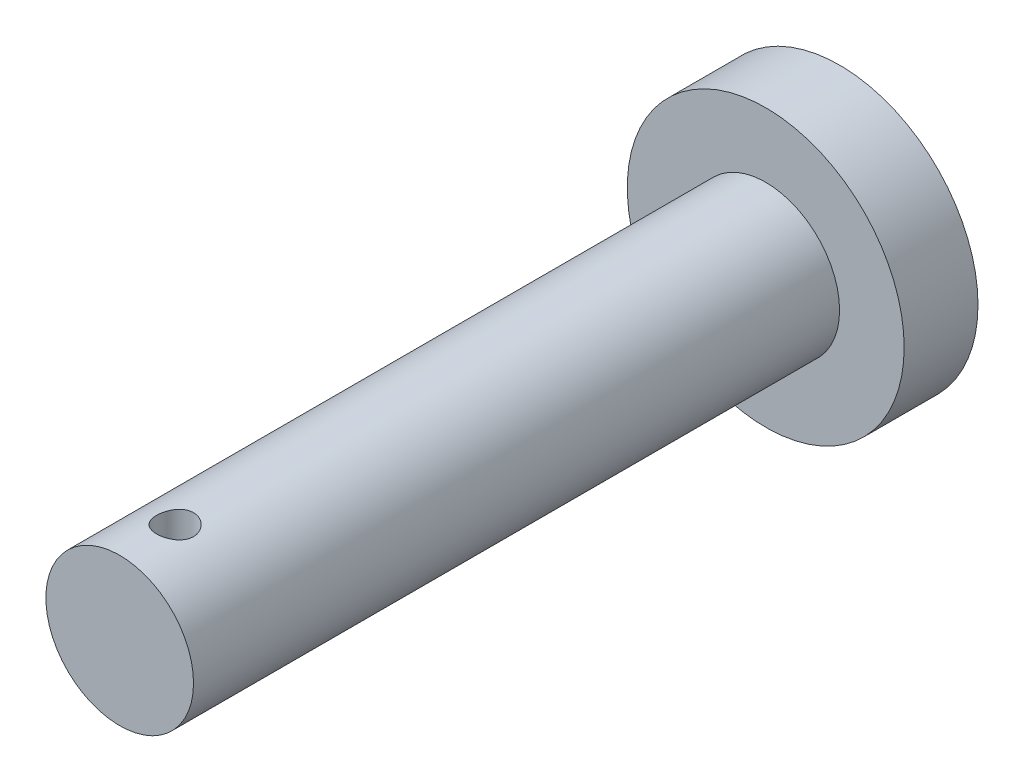
ISO-10303-21;
HEADER;
FILE_DESCRIPTION(('STEP AP214'),'2;1');
FILE_NAME('part.step','',(''),(''),'','','');
FILE_SCHEMA(('AUTOMOTIVE_DESIGN { 1 0 10303 214 1 1 1 1 }'));
ENDSEC;
DATA;
#1=APPLICATION_CONTEXT('core data for automotive mechanical design processes');
#2=APPLICATION_PROTOCOL_DEFINITION('international standard','automotive_design',2000,#1);
#3=PRODUCT_CONTEXT('',#1,'mechanical');
#4=PRODUCT('Part','Part','',(#3));
#5=PRODUCT_RELATED_PRODUCT_CATEGORY('part','',(#4));
#6=PRODUCT_DEFINITION_FORMATION('','',#4);
#7=PRODUCT_DEFINITION_CONTEXT('part definition',#1,'design');
#8=PRODUCT_DEFINITION('design','',#6,#7);
#9=PRODUCT_DEFINITION_SHAPE('','',#8);
#10=(LENGTH_UNIT() NAMED_UNIT(*) SI_UNIT(.MILLI.,.METRE.));
#11=(NAMED_UNIT(*) PLANE_ANGLE_UNIT() SI_UNIT($,.RADIAN.));
#12=(NAMED_UNIT(*) SI_UNIT($,.STERADIAN.) SOLID_ANGLE_UNIT());
#13=UNCERTAINTY_MEASURE_WITH_UNIT(LENGTH_MEASURE(1.E-05),#10,'distance_accuracy_value','');
#14=(GEOMETRIC_REPRESENTATION_CONTEXT(3) GLOBAL_UNCERTAINTY_ASSIGNED_CONTEXT((#13)) GLOBAL_UNIT_ASSIGNED_CONTEXT((#10,
#11,#12)) REPRESENTATION_CONTEXT('',''));
#15=CARTESIAN_POINT('',(0.,0.,0.));
#16=DIRECTION('',(0.,0.,1.));
#17=DIRECTION('',(1.,0.,0.));
#18=AXIS2_PLACEMENT_3D('',#15,#16,#17);
#19=CARTESIAN_POINT('',(0.,0.,8.75));
#20=DIRECTION('',(0.,0.,-1.));
#21=DIRECTION('',(1.,0.,0.));
#22=AXIS2_PLACEMENT_3D('',#19,#20,#21);
#23=CYLINDRICAL_SURFACE('',#22,2.);
#24=CARTESIAN_POINT('',(-0.402083580843982,-1.95916533095591,7.60170386885956));
#25=CARTESIAN_POINT('',(-0.382401175035829,-1.96320453400655,7.62431189247968));
#26=CARTESIAN_POINT('',(-0.360815571009597,-1.96732486967158,7.64525975378583));
#27=CARTESIAN_POINT('',(-0.314396918326236,-1.97527428498154,7.68326948825497));
#28=CARTESIAN_POINT('',(-0.289562381598017,-1.97910322988524,7.70032957086576));
#29=CARTESIAN_POINT('',(-0.237271935828046,-1.98605068903638,7.73007891141228));
#30=CARTESIAN_POINT('',(-0.209813569143578,-1.98916852777608,7.74276401919614));
#31=CARTESIAN_POINT('',(-0.153061270678351,-1.9943376980813,7.76332808373494));
#32=CARTESIAN_POINT('',(-0.123767884887116,-1.99638934520723,7.77120846266375));
#33=CARTESIAN_POINT('',(-0.0648800240902694,-1.99915973139406,7.78176902698042));
#34=CARTESIAN_POINT('',(-0.0353072409939558,-1.99990748930074,7.78456248921268));
#35=CARTESIAN_POINT('',(0.0238936744461542,-2.00007622698689,7.78519660071162));
#36=CARTESIAN_POINT('',(0.0535218008166035,-1.9994973425232,7.78303775675343));
#37=CARTESIAN_POINT('',(0.111331465837118,-1.99710418290124,7.77394485929492));
#38=CARTESIAN_POINT('',(0.139530373697293,-1.99531647652923,7.76711346757842));
#39=CARTESIAN_POINT('',(0.1943740712685,-1.99072263791091,7.74900752131947));
#40=CARTESIAN_POINT('',(0.221018727307608,-1.9879164182178,7.73773258525919));
#41=CARTESIAN_POINT('',(0.272493898277129,-1.98152252101768,7.71085574014534));
#42=CARTESIAN_POINT('',(0.297287002434992,-1.97792265637125,7.69518517789974));
#43=CARTESIAN_POINT('',(0.34394591219118,-1.97034536260905,7.66003671689537));
#44=CARTESIAN_POINT('',(0.365811119590012,-1.96636785662009,7.64055804209364));
#45=CARTESIAN_POINT('',(0.406709383766492,-1.95832481038612,7.59762721054773));
#46=CARTESIAN_POINT('',(0.425632191296246,-1.95426041836359,7.57406964775141));
#47=CARTESIAN_POINT('',(0.459279386022715,-1.94662813434441,7.52405100075266));
#48=CARTESIAN_POINT('',(0.474003707806079,-1.9430602500839,7.4975898713209));
#49=CARTESIAN_POINT('',(0.498833097654135,-1.93683518055102,7.44243594697692));
#50=CARTESIAN_POINT('',(0.508932196848207,-1.93417917315964,7.4137403239719));
#51=CARTESIAN_POINT('',(0.524143555506589,-1.93011306386062,7.3549735294201));
#52=CARTESIAN_POINT('',(0.529257039322722,-1.92870265607053,7.32490269749281));
#53=CARTESIAN_POINT('',(0.534238993776694,-1.92732848979126,7.26521858503779));
#54=CARTESIAN_POINT('',(0.534261929587191,-1.92732212764184,7.23561911374268));
#55=CARTESIAN_POINT('',(0.529449044191111,-1.92864973017506,7.17685047794165));
#56=CARTESIAN_POINT('',(0.524613488673774,-1.92998362156521,7.14768128999395));
#57=CARTESIAN_POINT('',(0.51033810064097,-1.93380664655718,7.09095829090651));
#58=CARTESIAN_POINT('',(0.50095529736206,-1.93628145312418,7.06338908745715));
#59=CARTESIAN_POINT('',(0.477899533396954,-1.94210006766961,7.01020622089649));
#60=CARTESIAN_POINT('',(0.464225917448787,-1.94544400836252,6.98459285721023));
#61=CARTESIAN_POINT('',(0.432561139580522,-1.95273160373383,6.93533026464054));
#62=CARTESIAN_POINT('',(0.414467700500976,-1.95668850353783,6.91174874714225));
#63=CARTESIAN_POINT('',(0.37463859004048,-1.96470299210552,6.86790918346495));
#64=CARTESIAN_POINT('',(0.352902334366307,-1.9687605969328,6.84765167147639));
#65=CARTESIAN_POINT('',(0.305806084041395,-1.97662955590711,6.81057614514322));
#66=CARTESIAN_POINT('',(0.280375248121333,-1.9804332647147,6.79384628732205));
#67=CARTESIAN_POINT('',(0.226957723627396,-1.98726295050511,6.7649191541237));
#68=CARTESIAN_POINT('',(0.198971345554694,-1.99028902180179,6.75272132901003));
#69=CARTESIAN_POINT('',(0.141711815283119,-1.99517647558453,6.73342075982819));
#70=CARTESIAN_POINT('',(0.112467490496456,-1.99705624019162,6.72623731800307));
#71=CARTESIAN_POINT('',(0.0531353405688532,-1.99951425246894,6.71689797425931));
#72=CARTESIAN_POINT('',(0.0230476995457652,-2.00009278202587,6.71474098345633));
#73=CARTESIAN_POINT('',(-0.0361223368669313,-1.99988595249718,6.7155186309777));
#74=CARTESIAN_POINT('',(-0.065207055479595,-1.99914220210434,6.71829793431269));
#75=CARTESIAN_POINT('',(-0.122477108921468,-1.99645220354969,6.7285517866559));
#76=CARTESIAN_POINT('',(-0.15066244351078,-1.99450595506714,6.73602633691649));
#77=CARTESIAN_POINT('',(-0.205357247671967,-1.98961878937712,6.7554239408597));
#78=CARTESIAN_POINT('',(-0.231866944263665,-1.98667800725598,6.76734639041207));
#79=CARTESIAN_POINT('',(-0.282540037837243,-1.98010727269151,6.79528458288575));
#80=CARTESIAN_POINT('',(-0.306703019910216,-1.97647719871257,6.81130104783455));
#81=CARTESIAN_POINT('',(-0.352789635866894,-1.96878197784867,6.84754374843005));
#82=CARTESIAN_POINT('',(-0.374622185099011,-1.96470692049263,6.86788374971425));
#83=CARTESIAN_POINT('',(-0.414616844985319,-1.95665786154173,6.91192031050817));
#84=CARTESIAN_POINT('',(-0.43277842113705,-1.95268387473652,6.93561735795871));
#85=CARTESIAN_POINT('',(-0.465242092248771,-1.94520777129324,6.98622650854431));
#86=CARTESIAN_POINT('',(-0.479466866493781,-1.94171570399899,7.01318982728125));
#87=CARTESIAN_POINT('',(-0.503166821482325,-1.93571012206215,7.06923005548123));
#88=CARTESIAN_POINT('',(-0.512642908818691,-1.93319642065587,7.09830656029191));
#89=CARTESIAN_POINT('',(-0.526379909890084,-1.92950102843636,7.15710150912883));
#90=CARTESIAN_POINT('',(-0.530746430903256,-1.92829240581666,7.18679354609653));
#91=CARTESIAN_POINT('',(-0.534466824981242,-1.92726471650606,7.24651406491472));
#92=CARTESIAN_POINT('',(-0.533821175775814,-1.92744551738369,7.27654251442796));
#93=CARTESIAN_POINT('',(-0.527625576438523,-1.92915023983919,7.33524851481118));
#94=CARTESIAN_POINT('',(-0.522204404438363,-1.93063889075532,7.36394085357697));
#95=CARTESIAN_POINT('',(-0.506814027497609,-1.93473574447013,7.41998527688823));
#96=CARTESIAN_POINT('',(-0.496846170277648,-1.93734361549798,7.44733775593389));
#97=CARTESIAN_POINT('',(-0.474100057999968,-1.94302567989786,7.49687703522856));
#98=CARTESIAN_POINT('',(-0.461792463231296,-1.94600848475939,7.51929246943399));
#99=CARTESIAN_POINT('',(-0.434142225349449,-1.95236310269926,7.56210584075319));
#100=CARTESIAN_POINT('',(-0.418799252614142,-1.95573495800935,7.58250355839501));
#101=CARTESIAN_POINT('',(-0.402083580843982,-1.95916533095591,7.60170386885956));
#102=B_SPLINE_CURVE_WITH_KNOTS('',3,(#24,#25,#26,#27,#28,#29,#30,#31,#32,#33,#34,#35,#36,#37,
#38,#39,#40,#41,#42,#43,#44,#45,#46,#47,#48,#49,#50,#51,#52,#53,#54,#55,#56,#57,#58,#59,#60,#61,
#62,#63,#64,#65,#66,#67,#68,#69,#70,#71,#72,#73,#74,#75,#76,#77,#78,#79,#80,#81,#82,#83,#84,#85,
#86,#87,#88,#89,#90,#91,#92,#93,#94,#95,#96,#97,#98,#99,#100,#101),.UNSPECIFIED.,.T.,.F.,(4,2,2,
2,2,2,2,2,2,2,2,2,2,2,2,2,2,2,2,2,2,2,2,2,2,2,2,2,2,2,2,2,2,2,2,2,2,2,4),(0.,0.0906485431880672,
0.18133875139868,0.272114754284168,0.362863874901053,0.451566234355926,0.540259517202652,
0.627064172981433,0.713876283336905,0.802127989254279,0.890397698483535,0.981434068915705,
1.0724718576375,1.1636268022619,1.25475935569766,1.34312623618703,1.43148828454849,
1.51876974624767,1.60606454343425,1.69561121236824,1.78517225800044,1.87675896967833,
1.96833456823951,2.05840014949195,2.14844621794647,2.23570871575389,2.32297123683707,
2.4102219099119,2.49748798129301,2.58742287685325,2.67737085773161,2.76897700941261,
2.86056566548866,2.95022587161817,3.0398775319839,3.12718318284317,3.21446297151177,
3.29143967295109,3.36842473814811),.UNSPECIFIED.);
#103=CARTESIAN_POINT('',(-0.402083580843982,-1.95916533095591,7.60170386885956));
#104=VERTEX_POINT('',#103);
#105=EDGE_CURVE('E36',#104,#104,#102,.T.);
#106=ORIENTED_EDGE('',*,*,#105,.T.);
#107=EDGE_LOOP('',(#106));
#108=FACE_BOUND('',#107,.T.);
#109=CARTESIAN_POINT('',(0.,0.,-8.75));
#110=DIRECTION('',(0.,0.,1.));
#111=DIRECTION('',(1.,0.,0.));
#112=AXIS2_PLACEMENT_3D('',#109,#110,#111);
#113=CIRCLE('',#112,2.);
#114=CARTESIAN_POINT('',(2.,0.,-8.75));
#115=VERTEX_POINT('',#114);
#116=EDGE_CURVE('E43',#115,#115,#113,.T.);
#117=ORIENTED_EDGE('',*,*,#116,.T.);
#118=EDGE_LOOP('',(#117));
#119=FACE_BOUND('',#118,.T.);
#120=CARTESIAN_POINT('',(0.,0.,8.75));
#121=DIRECTION('',(0.,0.,1.));
#122=DIRECTION('',(1.,0.,0.));
#123=AXIS2_PLACEMENT_3D('',#120,#121,#122);
#124=CIRCLE('',#123,2.);
#125=CARTESIAN_POINT('',(2.,0.,8.75));
#126=VERTEX_POINT('',#125);
#127=EDGE_CURVE('E10',#126,#126,#124,.T.);
#128=ORIENTED_EDGE('',*,*,#127,.F.);
#129=EDGE_LOOP('',(#128));
#130=FACE_BOUND('',#129,.T.);
#131=CARTESIAN_POINT('',(0.,2.,7.75));
#132=CARTESIAN_POINT('',(0.0276253628899104,1.99999953289338,7.74999922475395));
#133=CARTESIAN_POINT('',(0.0552593859435877,1.99942192710609,7.74770281640874));
#134=CARTESIAN_POINT('',(0.109735441256844,1.99717371276631,7.738591616231));
#135=CARTESIAN_POINT('',(0.13657701562358,1.99550248473323,7.73177426348739));
#136=CARTESIAN_POINT('',(0.188673624060859,1.99125208777347,7.71385358217931));
#137=CARTESIAN_POINT('',(0.213930521143335,1.98867400947362,7.70275540042824));
#138=CARTESIAN_POINT('',(0.262224043968142,1.98288447935864,7.67660620331839));
#139=CARTESIAN_POINT('',(0.28526059478292,1.97967300618017,7.66155505462702));
#140=CARTESIAN_POINT('',(0.328933975766973,1.97289137863934,7.62759973678193));
#141=CARTESIAN_POINT('',(0.349518563353691,1.96931569049511,7.60862947501361));
#142=CARTESIAN_POINT('',(0.387249642401102,1.96224540039176,7.56751593169703));
#143=CARTESIAN_POINT('',(0.404395745649712,1.95875080762783,7.54537229235117));
#144=CARTESIAN_POINT('',(0.435008847599677,1.9521825856657,7.49813492442086));
#145=CARTESIAN_POINT('',(0.448417405308452,1.94911598156868,7.47300225639653));
#146=CARTESIAN_POINT('',(0.470798969516843,1.94383164937408,7.42075052944721));
#147=CARTESIAN_POINT('',(0.479772685146444,1.94161378557596,7.39363178889141));
#148=CARTESIAN_POINT('',(0.492851612268097,1.93833492239184,7.33875216726584));
#149=CARTESIAN_POINT('',(0.497050756111113,1.93725163691809,7.31101503465007));
#150=CARTESIAN_POINT('',(0.500753925022618,1.9362978751258,7.25521047699534));
#151=CARTESIAN_POINT('',(0.500258713939326,1.93642720149548,7.2271431064338));
#152=CARTESIAN_POINT('',(0.49466217487976,1.93786401832206,7.17219473075184));
#153=CARTESIAN_POINT('',(0.489672780063507,1.93914287667293,7.14530145951163));
#154=CARTESIAN_POINT('',(0.475408062301036,1.94268903225495,7.0927463163629));
#155=CARTESIAN_POINT('',(0.466132434023141,1.94495639990232,7.06708453232367));
#156=CARTESIAN_POINT('',(0.443463159312385,1.95025037968062,7.01742066124931));
#157=CARTESIAN_POINT('',(0.430028889077637,1.95328442489807,6.99343794273682));
#158=CARTESIAN_POINT('',(0.399452092004984,1.95976570282129,6.94802709674772));
#159=CARTESIAN_POINT('',(0.382308916269613,1.96321300778245,6.92659941731092));
#160=CARTESIAN_POINT('',(0.344221141560406,1.9702529351326,6.8862654614352));
#161=CARTESIAN_POINT('',(0.323182086055287,1.9738468982599,6.86744850331288));
#162=CARTESIAN_POINT('',(0.278203972501233,1.98068655192929,6.8335929191787));
#163=CARTESIAN_POINT('',(0.254264825902648,1.98393223183138,6.81855440857881));
#164=CARTESIAN_POINT('',(0.204038629560463,1.98972577364727,6.79264980459187));
#165=CARTESIAN_POINT('',(0.177743797736207,1.99227120042575,6.78179821991519));
#166=CARTESIAN_POINT('',(0.123625336047627,1.99635972330473,6.76469423143014));
#167=CARTESIAN_POINT('',(0.0958019997168275,1.99790301113094,6.75844094786062));
#168=CARTESIAN_POINT('',(0.0401799901300081,1.99978499757125,6.75084747814705));
#169=CARTESIAN_POINT('',(0.0123989066627358,2.00015351169426,6.7493856579749));
#170=CARTESIAN_POINT('',(-0.0430109582671701,1.9997293493815,6.75108300068516));
#171=CARTESIAN_POINT('',(-0.0706397532148657,1.99893677747282,6.75424174759971));
#172=CARTESIAN_POINT('',(-0.124538089592164,1.99629860375786,6.76499030279713));
#173=CARTESIAN_POINT('',(-0.150821706322919,1.99446878061937,6.77251375449233));
#174=CARTESIAN_POINT('',(-0.201752430817504,1.98996235544711,6.79170236134282));
#175=CARTESIAN_POINT('',(-0.226399373010879,1.98728566789964,6.80336793477106));
#176=CARTESIAN_POINT('',(-0.27384104480995,1.98131102642103,6.83074537629158));
#177=CARTESIAN_POINT('',(-0.296595147278611,1.97800289122311,6.84652537079892));
#178=CARTESIAN_POINT('',(-0.339175537881083,1.97114836395806,6.88159663626566));
#179=CARTESIAN_POINT('',(-0.35900131965767,1.96760193083902,6.90088851320564));
#180=CARTESIAN_POINT('',(-0.395663522690911,1.96056318986924,6.94300065361482));
#181=CARTESIAN_POINT('',(-0.412414622540678,1.95707434729094,6.96589590100081));
#182=CARTESIAN_POINT('',(-0.441836919670899,1.95064292792413,7.01424421148857));
#183=CARTESIAN_POINT('',(-0.454508298052646,1.94770032689009,7.03969716098659));
#184=CARTESIAN_POINT('',(-0.475317140203098,1.94272698244888,7.09230190747103));
#185=CARTESIAN_POINT('',(-0.483481465551355,1.94069085097302,7.11944254278134));
#186=CARTESIAN_POINT('',(-0.495115219984593,1.93775581363394,7.17476987929637));
#187=CARTESIAN_POINT('',(-0.498585675826219,1.93685665906645,7.20295635034416));
#188=CARTESIAN_POINT('',(-0.500679530111332,1.93631633734652,7.25870700795174));
#189=CARTESIAN_POINT('',(-0.499439299260039,1.93663977576088,7.28626581170825));
#190=CARTESIAN_POINT('',(-0.492459092770956,1.93842636335948,7.34076796288933));
#191=CARTESIAN_POINT('',(-0.486719207562256,1.93988948963952,7.36771132267122));
#192=CARTESIAN_POINT('',(-0.470977106480931,1.94377086894241,7.42006948635514));
#193=CARTESIAN_POINT('',(-0.461000468226792,1.94618338412103,7.44549243508007));
#194=CARTESIAN_POINT('',(-0.437088304535023,1.95169251908276,7.4943217942379));
#195=CARTESIAN_POINT('',(-0.423152230011396,1.95478923373591,7.51772792439564));
#196=CARTESIAN_POINT('',(-0.391289249545712,1.96141878087837,7.56251820966734));
#197=CARTESIAN_POINT('',(-0.373267720970751,1.96496088277252,7.58383369114132));
#198=CARTESIAN_POINT('',(-0.333929790396578,1.97202675748762,7.62318234826514));
#199=CARTESIAN_POINT('',(-0.312612607087048,1.97555052575687,7.64121474337099));
#200=CARTESIAN_POINT('',(-0.266822528900863,1.98225885215888,7.67380376952154));
#201=CARTESIAN_POINT('',(-0.242299474105462,1.98543611121956,7.68829153789053));
#202=CARTESIAN_POINT('',(-0.191088686503491,1.99101641658373,7.71291582098018));
#203=CARTESIAN_POINT('',(-0.164402521145579,1.9934200173326,7.72305545354951));
#204=CARTESIAN_POINT('',(-0.114803417747823,1.99682686521847,7.73719061010989));
#205=CARTESIAN_POINT('',(-0.0921267236360225,1.9980086168423,7.74198374768448));
#206=CARTESIAN_POINT('',(-0.0463020238454277,1.99959535077316,7.74838864787398));
#207=CARTESIAN_POINT('',(-0.0231540537475387,2.00000039150298,7.75000064976844));
#208=CARTESIAN_POINT('',(0.,2.,7.75));
#209=B_SPLINE_CURVE_WITH_KNOTS('',3,(#131,#132,#133,#134,#135,#136,#137,#138,#139,#140,#141,
#142,#143,#144,#145,#146,#147,#148,#149,#150,#151,#152,#153,#154,#155,#156,#157,#158,#159,#160,
#161,#162,#163,#164,#165,#166,#167,#168,#169,#170,#171,#172,#173,#174,#175,#176,#177,#178,#179,
#180,#181,#182,#183,#184,#185,#186,#187,#188,#189,#190,#191,#192,#193,#194,#195,#196,#197,#198,
#199,#200,#201,#202,#203,#204,#205,#206,#207,#208),.UNSPECIFIED.,.T.,.F.,(4,2,2,2,2,2,2,2,2,2,2,
2,2,2,2,2,2,2,2,2,2,2,2,2,2,2,2,2,2,2,2,2,2,2,2,2,2,2,4),(0.,0.0827912374906299,
0.165629412587967,0.248368300762035,0.331109980056443,0.41538145145713,0.49966243193354,
0.585195491819357,0.670714870564562,0.754520983664769,0.838313460375658,0.920074990023394,
1.0018423448868,1.08443509291293,1.16704230278721,1.25200500323006,1.33697029852749,
1.42222743003038,1.50746824562881,1.59052769649759,1.67357967037581,1.75540091504679,
1.83723042440764,1.92051195855117,2.0038078766934,2.08914836401492,2.17448506249836,
2.25930751538012,2.34411141084136,2.42647926799538,2.50884546985345,2.59072133519816,
2.67260856045634,2.75663192136637,2.84067523256806,2.92624061833196,3.01174454607117,
3.08114080980716,3.1505318534768),.UNSPECIFIED.);
#210=CARTESIAN_POINT('',(0.,2.,7.75));
#211=VERTEX_POINT('',#210);
#212=EDGE_CURVE('E53',#211,#211,#209,.T.);
#213=ORIENTED_EDGE('',*,*,#212,.F.);
#214=EDGE_LOOP('',(#213));
#215=FACE_BOUND('',#214,.T.);
#216=ADVANCED_FACE('F32',(#108,#119,#130,#215),#23,.T.);
#217=CARTESIAN_POINT('',(0.,0.,8.75));
#218=DIRECTION('',(0.,0.,-1.));
#219=DIRECTION('',(1.,0.,0.));
#220=AXIS2_PLACEMENT_3D('',#217,#218,#219);
#221=PLANE('',#220);
#222=ORIENTED_EDGE('',*,*,#127,.T.);
#223=EDGE_LOOP('',(#222));
#224=FACE_BOUND('',#223,.T.);
#225=ADVANCED_FACE('F78',(#224),#221,.F.);
#226=CARTESIAN_POINT('',(0.,0.,-10.75));
#227=DIRECTION('',(0.,0.,1.));
#228=DIRECTION('',(-1.,0.,0.));
#229=AXIS2_PLACEMENT_3D('',#226,#227,#228);
#230=CYLINDRICAL_SURFACE('',#229,3.75);
#231=CARTESIAN_POINT('',(0.,0.,-10.75));
#232=DIRECTION('',(0.,0.,1.));
#233=DIRECTION('',(1.,0.,0.));
#234=AXIS2_PLACEMENT_3D('',#231,#232,#233);
#235=CIRCLE('',#234,3.75);
#236=CARTESIAN_POINT('',(3.75,0.,-10.75));
#237=VERTEX_POINT('',#236);
#238=EDGE_CURVE('E48',#237,#237,#235,.T.);
#239=ORIENTED_EDGE('',*,*,#238,.T.);
#240=EDGE_LOOP('',(#239));
#241=FACE_BOUND('',#240,.T.);
#242=CARTESIAN_POINT('',(0.,0.,-8.75));
#243=DIRECTION('',(0.,0.,1.));
#244=DIRECTION('',(1.,0.,0.));
#245=AXIS2_PLACEMENT_3D('',#242,#243,#244);
#246=CIRCLE('',#245,3.75);
#247=CARTESIAN_POINT('',(3.75,0.,-8.75));
#248=VERTEX_POINT('',#247);
#249=EDGE_CURVE('E51',#248,#248,#246,.T.);
#250=ORIENTED_EDGE('',*,*,#249,.F.);
#251=EDGE_LOOP('',(#250));
#252=FACE_BOUND('',#251,.T.);
#253=ADVANCED_FACE('F72',(#241,#252),#230,.T.);
#254=CARTESIAN_POINT('',(0.,0.,-10.75));
#255=DIRECTION('',(0.,0.,-1.));
#256=DIRECTION('',(1.,0.,0.));
#257=AXIS2_PLACEMENT_3D('',#254,#255,#256);
#258=PLANE('',#257);
#259=ORIENTED_EDGE('',*,*,#238,.F.);
#260=EDGE_LOOP('',(#259));
#261=FACE_BOUND('',#260,.T.);
#262=ADVANCED_FACE('F69',(#261),#258,.T.);
#263=CARTESIAN_POINT('',(0.,0.,-8.75));
#264=DIRECTION('',(0.,0.,-1.));
#265=DIRECTION('',(1.,0.,0.));
#266=AXIS2_PLACEMENT_3D('',#263,#264,#265);
#267=PLANE('',#266);
#268=ORIENTED_EDGE('',*,*,#116,.F.);
#269=EDGE_LOOP('',(#268));
#270=FACE_BOUND('',#269,.T.);
#271=ORIENTED_EDGE('',*,*,#249,.T.);
#272=EDGE_LOOP('',(#271));
#273=FACE_BOUND('',#272,.T.);
#274=ADVANCED_FACE('F67',(#270,#273),#267,.F.);
#275=CARTESIAN_POINT('',(0.,0.,7.25));
#276=DIRECTION('',(0.,-1.,0.));
#277=DIRECTION('',(0.,0.,-1.));
#278=AXIS2_PLACEMENT_3D('',#275,#276,#277);
#279=CONICAL_SURFACE('',#278,0.5,0.0174532925199433);
#280=ORIENTED_EDGE('',*,*,#105,.F.);
#281=EDGE_LOOP('',(#280));
#282=FACE_BOUND('',#281,.T.);
#283=CARTESIAN_POINT('',(0.,0.,7.25));
#284=DIRECTION('',(0.,-1.,0.));
#285=DIRECTION('',(0.,0.,-1.));
#286=AXIS2_PLACEMENT_3D('',#283,#284,#285);
#287=CIRCLE('',#286,0.5);
#288=CARTESIAN_POINT('',(0.,0.,6.75));
#289=VERTEX_POINT('',#288);
#290=EDGE_CURVE('E58',#289,#289,#287,.T.);
#291=ORIENTED_EDGE('',*,*,#290,.F.);
#292=EDGE_LOOP('',(#291));
#293=FACE_BOUND('',#292,.T.);
#294=ADVANCED_FACE('F62',(#282,#293),#279,.F.);
#295=CARTESIAN_POINT('',(0.,3.75,7.25));
#296=DIRECTION('',(0.,-1.,0.));
#297=DIRECTION('',(0.,0.,1.));
#298=AXIS2_PLACEMENT_3D('',#295,#296,#297);
#299=CYLINDRICAL_SURFACE('',#298,0.5);
#300=ORIENTED_EDGE('',*,*,#212,.T.);
#301=EDGE_LOOP('',(#300));
#302=FACE_BOUND('',#301,.T.);
#303=ORIENTED_EDGE('',*,*,#290,.T.);
#304=EDGE_LOOP('',(#303));
#305=FACE_BOUND('',#304,.T.);
#306=ADVANCED_FACE('F59',(#302,#305),#299,.F.);
#307=CLOSED_SHELL('',(#216,#225,#253,#262,#274,#294,#306));
#308=MANIFOLD_SOLID_BREP('B2',#307);
#309=ADVANCED_BREP_SHAPE_REPRESENTATION('',(#18,#308),#14);
#310=SHAPE_DEFINITION_REPRESENTATION(#9,#309);
ENDSEC;
END-ISO-10303-21;
